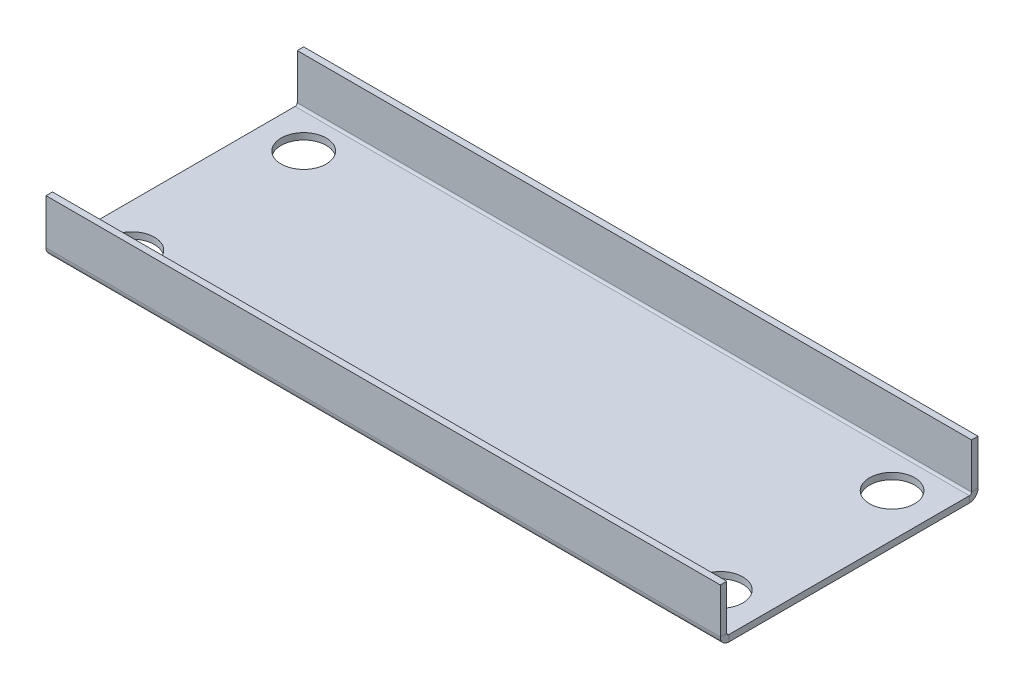
ISO-10303-21;
HEADER;
FILE_DESCRIPTION(('STEP AP214'),'2;1');
FILE_NAME('part.step','',(''),(''),'','','');
FILE_SCHEMA(('AUTOMOTIVE_DESIGN { 1 0 10303 214 1 1 1 1 }'));
ENDSEC;
DATA;
#1=APPLICATION_CONTEXT('core data for automotive mechanical design processes');
#2=APPLICATION_PROTOCOL_DEFINITION('international standard','automotive_design',2000,#1);
#3=PRODUCT_CONTEXT('',#1,'mechanical');
#4=PRODUCT('Part','Part','',(#3));
#5=PRODUCT_RELATED_PRODUCT_CATEGORY('part','',(#4));
#6=PRODUCT_DEFINITION_FORMATION('','',#4);
#7=PRODUCT_DEFINITION_CONTEXT('part definition',#1,'design');
#8=PRODUCT_DEFINITION('design','',#6,#7);
#9=PRODUCT_DEFINITION_SHAPE('','',#8);
#10=(LENGTH_UNIT() NAMED_UNIT(*) SI_UNIT(.MILLI.,.METRE.));
#11=(NAMED_UNIT(*) PLANE_ANGLE_UNIT() SI_UNIT($,.RADIAN.));
#12=(NAMED_UNIT(*) SI_UNIT($,.STERADIAN.) SOLID_ANGLE_UNIT());
#13=UNCERTAINTY_MEASURE_WITH_UNIT(LENGTH_MEASURE(1.E-05),#10,'distance_accuracy_value','');
#14=(GEOMETRIC_REPRESENTATION_CONTEXT(3) GLOBAL_UNCERTAINTY_ASSIGNED_CONTEXT((#13)) GLOBAL_UNIT_ASSIGNED_CONTEXT((#10,
#11,#12)) REPRESENTATION_CONTEXT('',''));
#15=CARTESIAN_POINT('',(0.,0.,0.));
#16=DIRECTION('',(0.,0.,1.));
#17=DIRECTION('',(1.,0.,0.));
#18=AXIS2_PLACEMENT_3D('',#15,#16,#17);
#19=CARTESIAN_POINT('',(0.,3.,0.));
#20=DIRECTION('',(0.,-1.,0.));
#21=DIRECTION('',(0.,0.,-1.));
#22=AXIS2_PLACEMENT_3D('',#19,#20,#21);
#23=PLANE('',#22);
#24=CARTESIAN_POINT('',(137.,3.,40.));
#25=DIRECTION('',(0.,-1.,0.));
#26=DIRECTION('',(0.,0.,-1.));
#27=AXIS2_PLACEMENT_3D('',#24,#25,#26);
#28=CIRCLE('',#27,10.5);
#29=CARTESIAN_POINT('',(137.,3.,29.5));
#30=VERTEX_POINT('',#29);
#31=EDGE_CURVE('E589',#30,#30,#28,.F.);
#32=ORIENTED_EDGE('',*,*,#31,.F.);
#33=EDGE_LOOP('',(#32));
#34=FACE_BOUND('',#33,.T.);
#35=CARTESIAN_POINT('',(137.,3.,-40.));
#36=DIRECTION('',(0.,-1.,0.));
#37=DIRECTION('',(0.,0.,-1.));
#38=AXIS2_PLACEMENT_3D('',#35,#36,#37);
#39=CIRCLE('',#38,10.5);
#40=CARTESIAN_POINT('',(137.,3.,-50.5));
#41=VERTEX_POINT('',#40);
#42=EDGE_CURVE('E596',#41,#41,#39,.F.);
#43=ORIENTED_EDGE('',*,*,#42,.F.);
#44=EDGE_LOOP('',(#43));
#45=FACE_BOUND('',#44,.T.);
#46=CARTESIAN_POINT('',(-137.,3.,-40.));
#47=DIRECTION('',(0.,-1.,0.));
#48=DIRECTION('',(0.,0.,-1.));
#49=AXIS2_PLACEMENT_3D('',#46,#47,#48);
#50=CIRCLE('',#49,10.5);
#51=CARTESIAN_POINT('',(-137.,3.,-50.5));
#52=VERTEX_POINT('',#51);
#53=EDGE_CURVE('E588',#52,#52,#50,.F.);
#54=ORIENTED_EDGE('',*,*,#53,.F.);
#55=EDGE_LOOP('',(#54));
#56=FACE_BOUND('',#55,.T.);
#57=CARTESIAN_POINT('',(-137.,3.,40.));
#58=DIRECTION('',(0.,-1.,0.));
#59=DIRECTION('',(0.,0.,-1.));
#60=AXIS2_PLACEMENT_3D('',#57,#58,#59);
#61=CIRCLE('',#60,10.5);
#62=CARTESIAN_POINT('',(-137.,3.,29.5));
#63=VERTEX_POINT('',#62);
#64=EDGE_CURVE('E575',#63,#63,#61,.F.);
#65=ORIENTED_EDGE('',*,*,#64,.F.);
#66=EDGE_LOOP('',(#65));
#67=FACE_BOUND('',#66,.T.);
#68=DIRECTION('',(-1.,0.,0.));
#69=VECTOR('',#68,1.);
#70=CARTESIAN_POINT('',(-157.,2.99999999999998,-56.));
#71=LINE('',#70,#69);
#72=CARTESIAN_POINT('',(-157.,2.99999999999998,-56.));
#73=VERTEX_POINT('',#72);
#74=CARTESIAN_POINT('',(157.,2.99999999999998,-56.));
#75=VERTEX_POINT('',#74);
#76=EDGE_CURVE('E182',#73,#75,#71,.F.);
#77=ORIENTED_EDGE('',*,*,#76,.F.);
#78=DIRECTION('',(0.,0.,1.));
#79=VECTOR('',#78,1.);
#80=CARTESIAN_POINT('',(-157.,3.,57.));
#81=LINE('',#80,#79);
#82=CARTESIAN_POINT('',(-157.,3.,56.));
#83=VERTEX_POINT('',#82);
#84=EDGE_CURVE('E11',#73,#83,#81,.T.);
#85=ORIENTED_EDGE('',*,*,#84,.T.);
#86=DIRECTION('',(1.,0.,0.));
#87=VECTOR('',#86,1.);
#88=CARTESIAN_POINT('',(157.,3.,56.));
#89=LINE('',#88,#87);
#90=CARTESIAN_POINT('',(157.,3.,56.));
#91=VERTEX_POINT('',#90);
#92=EDGE_CURVE('E230',#91,#83,#89,.F.);
#93=ORIENTED_EDGE('',*,*,#92,.F.);
#94=DIRECTION('',(0.,0.,-1.));
#95=VECTOR('',#94,1.);
#96=CARTESIAN_POINT('',(157.,3.,57.));
#97=LINE('',#96,#95);
#98=EDGE_CURVE('E47',#91,#75,#97,.T.);
#99=ORIENTED_EDGE('',*,*,#98,.T.);
#100=EDGE_LOOP('',(#77,#85,#93,#99));
#101=FACE_BOUND('',#100,.T.);
#102=ADVANCED_FACE('F38',(#34,#45,#56,#67,#101),#23,.F.);
#103=CARTESIAN_POINT('',(0.,0.,0.));
#104=DIRECTION('',(0.,-1.,0.));
#105=DIRECTION('',(0.,0.,-1.));
#106=AXIS2_PLACEMENT_3D('',#103,#104,#105);
#107=PLANE('',#106);
#108=CARTESIAN_POINT('',(137.,0.,40.));
#109=DIRECTION('',(0.,-1.,0.));
#110=DIRECTION('',(0.,0.,1.));
#111=AXIS2_PLACEMENT_3D('',#108,#109,#110);
#112=CIRCLE('',#111,10.5);
#113=CARTESIAN_POINT('',(137.,0.,50.5));
#114=VERTEX_POINT('',#113);
#115=EDGE_CURVE('E593',#114,#114,#112,.T.);
#116=ORIENTED_EDGE('',*,*,#115,.F.);
#117=EDGE_LOOP('',(#116));
#118=FACE_BOUND('',#117,.T.);
#119=CARTESIAN_POINT('',(137.,0.,-40.));
#120=DIRECTION('',(0.,-1.,0.));
#121=DIRECTION('',(0.,0.,-1.));
#122=AXIS2_PLACEMENT_3D('',#119,#120,#121);
#123=CIRCLE('',#122,10.5);
#124=CARTESIAN_POINT('',(137.,0.,-50.5));
#125=VERTEX_POINT('',#124);
#126=EDGE_CURVE('E592',#125,#125,#123,.T.);
#127=ORIENTED_EDGE('',*,*,#126,.F.);
#128=EDGE_LOOP('',(#127));
#129=FACE_BOUND('',#128,.T.);
#130=CARTESIAN_POINT('',(-137.,0.,-40.));
#131=DIRECTION('',(0.,-1.,0.));
#132=DIRECTION('',(0.,0.,1.));
#133=AXIS2_PLACEMENT_3D('',#130,#131,#132);
#134=CIRCLE('',#133,10.5);
#135=CARTESIAN_POINT('',(-137.,0.,-29.5));
#136=VERTEX_POINT('',#135);
#137=EDGE_CURVE('E599',#136,#136,#134,.T.);
#138=ORIENTED_EDGE('',*,*,#137,.F.);
#139=EDGE_LOOP('',(#138));
#140=FACE_BOUND('',#139,.T.);
#141=CARTESIAN_POINT('',(-137.,0.,40.));
#142=DIRECTION('',(0.,-1.,0.));
#143=DIRECTION('',(0.,0.,-1.));
#144=AXIS2_PLACEMENT_3D('',#141,#142,#143);
#145=CIRCLE('',#144,10.5);
#146=CARTESIAN_POINT('',(-137.,0.,29.5));
#147=VERTEX_POINT('',#146);
#148=EDGE_CURVE('E585',#147,#147,#145,.T.);
#149=ORIENTED_EDGE('',*,*,#148,.F.);
#150=EDGE_LOOP('',(#149));
#151=FACE_BOUND('',#150,.T.);
#152=DIRECTION('',(0.,0.,-1.));
#153=VECTOR('',#152,1.);
#154=CARTESIAN_POINT('',(-157.,0.,0.));
#155=LINE('',#154,#153);
#156=CARTESIAN_POINT('',(-157.,0.,-56.));
#157=VERTEX_POINT('',#156);
#158=CARTESIAN_POINT('',(-157.,0.,56.));
#159=VERTEX_POINT('',#158);
#160=EDGE_CURVE('E42',#157,#159,#155,.F.);
#161=ORIENTED_EDGE('',*,*,#160,.F.);
#162=DIRECTION('',(-1.,0.,0.));
#163=VECTOR('',#162,1.);
#164=CARTESIAN_POINT('',(-157.,0.,-56.));
#165=LINE('',#164,#163);
#166=CARTESIAN_POINT('',(157.,0.,-56.));
#167=VERTEX_POINT('',#166);
#168=EDGE_CURVE('E133',#157,#167,#165,.F.);
#169=ORIENTED_EDGE('',*,*,#168,.T.);
#170=DIRECTION('',(0.,0.,-1.));
#171=VECTOR('',#170,1.);
#172=CARTESIAN_POINT('',(157.,0.,0.));
#173=LINE('',#172,#171);
#174=CARTESIAN_POINT('',(157.,0.,56.));
#175=VERTEX_POINT('',#174);
#176=EDGE_CURVE('E236',#175,#167,#173,.T.);
#177=ORIENTED_EDGE('',*,*,#176,.F.);
#178=DIRECTION('',(1.,0.,0.));
#179=VECTOR('',#178,1.);
#180=CARTESIAN_POINT('',(157.,0.,56.));
#181=LINE('',#180,#179);
#182=EDGE_CURVE('E219',#175,#159,#181,.F.);
#183=ORIENTED_EDGE('',*,*,#182,.T.);
#184=EDGE_LOOP('',(#161,#169,#177,#183));
#185=FACE_BOUND('',#184,.T.);
#186=ADVANCED_FACE('F250',(#118,#129,#140,#151,#185),#107,.T.);
#187=CARTESIAN_POINT('',(-157.,3.,57.));
#188=DIRECTION('',(1.,0.,0.));
#189=DIRECTION('',(0.,0.,1.));
#190=AXIS2_PLACEMENT_3D('',#187,#188,#189);
#191=PLANE('',#190);
#192=ORIENTED_EDGE('',*,*,#84,.F.);
#193=DIRECTION('',(0.,-1.,0.));
#194=VECTOR('',#193,1.);
#195=CARTESIAN_POINT('',(-157.,2.99999999999998,-56.));
#196=LINE('',#195,#194);
#197=EDGE_CURVE('E178',#73,#157,#196,.T.);
#198=ORIENTED_EDGE('',*,*,#197,.T.);
#199=ORIENTED_EDGE('',*,*,#160,.T.);
#200=DIRECTION('',(0.,-1.,0.));
#201=VECTOR('',#200,1.);
#202=CARTESIAN_POINT('',(-157.,3.,56.));
#203=LINE('',#202,#201);
#204=EDGE_CURVE('E234',#83,#159,#203,.T.);
#205=ORIENTED_EDGE('',*,*,#204,.F.);
#206=EDGE_LOOP('',(#192,#198,#199,#205));
#207=FACE_BOUND('',#206,.T.);
#208=ADVANCED_FACE('F40',(#207),#191,.F.);
#209=CARTESIAN_POINT('',(157.,3.,57.));
#210=DIRECTION('',(-1.,0.,0.));
#211=DIRECTION('',(0.,0.,-1.));
#212=AXIS2_PLACEMENT_3D('',#209,#210,#211);
#213=PLANE('',#212);
#214=DIRECTION('',(0.,-1.,0.));
#215=VECTOR('',#214,1.);
#216=CARTESIAN_POINT('',(157.,2.99999999999998,-56.));
#217=LINE('',#216,#215);
#218=EDGE_CURVE('E185',#75,#167,#217,.T.);
#219=ORIENTED_EDGE('',*,*,#218,.F.);
#220=ORIENTED_EDGE('',*,*,#98,.F.);
#221=DIRECTION('',(0.,-1.,0.));
#222=VECTOR('',#221,1.);
#223=CARTESIAN_POINT('',(157.,3.,56.));
#224=LINE('',#223,#222);
#225=EDGE_CURVE('E224',#91,#175,#224,.T.);
#226=ORIENTED_EDGE('',*,*,#225,.T.);
#227=ORIENTED_EDGE('',*,*,#176,.T.);
#228=EDGE_LOOP('',(#219,#220,#226,#227));
#229=FACE_BOUND('',#228,.T.);
#230=ADVANCED_FACE('F258',(#229),#213,.F.);
#231=CARTESIAN_POINT('',(-157.,4.,56.));
#232=DIRECTION('',(-1.,0.,0.));
#233=DIRECTION('',(0.,0.,1.));
#234=AXIS2_PLACEMENT_3D('',#231,#232,#233);
#235=PLANE('',#234);
#236=DIRECTION('',(0.,0.,1.));
#237=VECTOR('',#236,1.);
#238=CARTESIAN_POINT('',(-157.,4.,57.));
#239=LINE('',#238,#237);
#240=CARTESIAN_POINT('',(-157.,4.,57.));
#241=VERTEX_POINT('',#240);
#242=CARTESIAN_POINT('',(-157.,4.,60.));
#243=VERTEX_POINT('',#242);
#244=EDGE_CURVE('E187',#241,#243,#239,.T.);
#245=ORIENTED_EDGE('',*,*,#244,.F.);
#246=CARTESIAN_POINT('',(-157.,4.,56.));
#247=DIRECTION('',(1.,0.,0.));
#248=DIRECTION('',(0.,0.,-1.));
#249=AXIS2_PLACEMENT_3D('',#246,#247,#248);
#250=CIRCLE('',#249,1.);
#251=EDGE_CURVE('E227',#83,#241,#250,.F.);
#252=ORIENTED_EDGE('',*,*,#251,.F.);
#253=ORIENTED_EDGE('',*,*,#204,.T.);
#254=CARTESIAN_POINT('',(-157.,4.,56.));
#255=DIRECTION('',(1.,0.,0.));
#256=DIRECTION('',(0.,0.,-1.));
#257=AXIS2_PLACEMENT_3D('',#254,#255,#256);
#258=CIRCLE('',#257,4.);
#259=EDGE_CURVE('E55',#159,#243,#258,.F.);
#260=ORIENTED_EDGE('',*,*,#259,.T.);
#261=EDGE_LOOP('',(#245,#252,#253,#260));
#262=FACE_BOUND('',#261,.T.);
#263=ADVANCED_FACE('F267',(#262),#235,.T.);
#264=CARTESIAN_POINT('',(157.,4.,56.));
#265=DIRECTION('',(-1.,0.,0.));
#266=DIRECTION('',(0.,0.,1.));
#267=AXIS2_PLACEMENT_3D('',#264,#265,#266);
#268=PLANE('',#267);
#269=CARTESIAN_POINT('',(157.,4.,56.));
#270=DIRECTION('',(1.,0.,0.));
#271=DIRECTION('',(0.,0.,-1.));
#272=AXIS2_PLACEMENT_3D('',#269,#270,#271);
#273=CIRCLE('',#272,1.);
#274=CARTESIAN_POINT('',(157.,4.,57.));
#275=VERTEX_POINT('',#274);
#276=EDGE_CURVE('E218',#275,#91,#273,.T.);
#277=ORIENTED_EDGE('',*,*,#276,.F.);
#278=DIRECTION('',(0.,0.,1.));
#279=VECTOR('',#278,1.);
#280=CARTESIAN_POINT('',(157.,4.00000000000001,57.));
#281=LINE('',#280,#279);
#282=CARTESIAN_POINT('',(157.,4.00000000000001,60.));
#283=VERTEX_POINT('',#282);
#284=EDGE_CURVE('E191',#275,#283,#281,.T.);
#285=ORIENTED_EDGE('',*,*,#284,.T.);
#286=CARTESIAN_POINT('',(157.,4.,56.));
#287=DIRECTION('',(1.,0.,0.));
#288=DIRECTION('',(0.,0.,-1.));
#289=AXIS2_PLACEMENT_3D('',#286,#287,#288);
#290=CIRCLE('',#289,4.);
#291=EDGE_CURVE('E222',#283,#175,#290,.T.);
#292=ORIENTED_EDGE('',*,*,#291,.T.);
#293=ORIENTED_EDGE('',*,*,#225,.F.);
#294=EDGE_LOOP('',(#277,#285,#292,#293));
#295=FACE_BOUND('',#294,.T.);
#296=ADVANCED_FACE('F254',(#295),#268,.F.);
#297=CARTESIAN_POINT('',(157.,4.,56.));
#298=DIRECTION('',(1.,0.,0.));
#299=DIRECTION('',(0.,0.,1.));
#300=AXIS2_PLACEMENT_3D('',#297,#298,#299);
#301=CYLINDRICAL_SURFACE('',#300,4.);
#302=ORIENTED_EDGE('',*,*,#182,.F.);
#303=ORIENTED_EDGE('',*,*,#291,.F.);
#304=DIRECTION('',(-1.,0.,0.));
#305=VECTOR('',#304,1.);
#306=CARTESIAN_POINT('',(0.,4.,60.));
#307=LINE('',#306,#305);
#308=EDGE_CURVE('E194',#283,#243,#307,.T.);
#309=ORIENTED_EDGE('',*,*,#308,.T.);
#310=ORIENTED_EDGE('',*,*,#259,.F.);
#311=EDGE_LOOP('',(#302,#303,#309,#310));
#312=FACE_BOUND('',#311,.T.);
#313=ADVANCED_FACE('F251',(#312),#301,.T.);
#314=CARTESIAN_POINT('',(157.,4.,56.));
#315=DIRECTION('',(1.,0.,0.));
#316=DIRECTION('',(0.,0.,1.));
#317=AXIS2_PLACEMENT_3D('',#314,#315,#316);
#318=CYLINDRICAL_SURFACE('',#317,1.);
#319=ORIENTED_EDGE('',*,*,#92,.T.);
#320=ORIENTED_EDGE('',*,*,#251,.T.);
#321=DIRECTION('',(1.,0.,0.));
#322=VECTOR('',#321,1.);
#323=CARTESIAN_POINT('',(-157.,4.,57.));
#324=LINE('',#323,#322);
#325=EDGE_CURVE('E189',#241,#275,#324,.T.);
#326=ORIENTED_EDGE('',*,*,#325,.T.);
#327=ORIENTED_EDGE('',*,*,#276,.T.);
#328=EDGE_LOOP('',(#319,#320,#326,#327));
#329=FACE_BOUND('',#328,.T.);
#330=ADVANCED_FACE('F264',(#329),#318,.F.);
#331=CARTESIAN_POINT('',(-157.,3.,60.));
#332=DIRECTION('',(1.,0.,0.));
#333=DIRECTION('',(0.,1.,0.));
#334=AXIS2_PLACEMENT_3D('',#331,#332,#333);
#335=PLANE('',#334);
#336=ORIENTED_EDGE('',*,*,#244,.T.);
#337=DIRECTION('',(0.,-1.,0.));
#338=VECTOR('',#337,1.);
#339=CARTESIAN_POINT('',(-157.,3.,60.));
#340=LINE('',#339,#338);
#341=CARTESIAN_POINT('',(-157.,25.,60.));
#342=VERTEX_POINT('',#341);
#343=EDGE_CURVE('E199',#342,#243,#340,.T.);
#344=ORIENTED_EDGE('',*,*,#343,.F.);
#345=DIRECTION('',(0.,0.,-1.));
#346=VECTOR('',#345,1.);
#347=CARTESIAN_POINT('',(-157.,25.,60.));
#348=LINE('',#347,#346);
#349=CARTESIAN_POINT('',(-157.,25.,57.));
#350=VERTEX_POINT('',#349);
#351=EDGE_CURVE('E207',#342,#350,#348,.T.);
#352=ORIENTED_EDGE('',*,*,#351,.T.);
#353=DIRECTION('',(0.,-1.,0.));
#354=VECTOR('',#353,1.);
#355=CARTESIAN_POINT('',(-157.,3.,57.));
#356=LINE('',#355,#354);
#357=EDGE_CURVE('E198',#350,#241,#356,.T.);
#358=ORIENTED_EDGE('',*,*,#357,.T.);
#359=EDGE_LOOP('',(#336,#344,#352,#358));
#360=FACE_BOUND('',#359,.T.);
#361=ADVANCED_FACE('F270',(#360),#335,.F.);
#362=CARTESIAN_POINT('',(157.,25.,60.));
#363=DIRECTION('',(-1.,0.,0.));
#364=DIRECTION('',(0.,-1.,0.));
#365=AXIS2_PLACEMENT_3D('',#362,#363,#364);
#366=PLANE('',#365);
#367=ORIENTED_EDGE('',*,*,#284,.F.);
#368=DIRECTION('',(0.,1.,0.));
#369=VECTOR('',#368,1.);
#370=CARTESIAN_POINT('',(157.,25.,57.));
#371=LINE('',#370,#369);
#372=CARTESIAN_POINT('',(157.,25.,57.));
#373=VERTEX_POINT('',#372);
#374=EDGE_CURVE('E210',#275,#373,#371,.T.);
#375=ORIENTED_EDGE('',*,*,#374,.T.);
#376=DIRECTION('',(0.,0.,-1.));
#377=VECTOR('',#376,1.);
#378=CARTESIAN_POINT('',(157.,25.,60.));
#379=LINE('',#378,#377);
#380=CARTESIAN_POINT('',(157.,25.,60.));
#381=VERTEX_POINT('',#380);
#382=EDGE_CURVE('E215',#381,#373,#379,.T.);
#383=ORIENTED_EDGE('',*,*,#382,.F.);
#384=DIRECTION('',(0.,1.,0.));
#385=VECTOR('',#384,1.);
#386=CARTESIAN_POINT('',(157.,25.,60.));
#387=LINE('',#386,#385);
#388=EDGE_CURVE('E202',#283,#381,#387,.T.);
#389=ORIENTED_EDGE('',*,*,#388,.F.);
#390=EDGE_LOOP('',(#367,#375,#383,#389));
#391=FACE_BOUND('',#390,.T.);
#392=ADVANCED_FACE('F285',(#391),#366,.F.);
#393=CARTESIAN_POINT('',(0.,0.,60.));
#394=DIRECTION('',(0.,0.,-1.));
#395=DIRECTION('',(-1.,0.,0.));
#396=AXIS2_PLACEMENT_3D('',#393,#394,#395);
#397=PLANE('',#396);
#398=ORIENTED_EDGE('',*,*,#308,.F.);
#399=ORIENTED_EDGE('',*,*,#388,.T.);
#400=DIRECTION('',(-1.,0.,0.));
#401=VECTOR('',#400,1.);
#402=CARTESIAN_POINT('',(-157.,25.,60.));
#403=LINE('',#402,#401);
#404=EDGE_CURVE('E205',#381,#342,#403,.T.);
#405=ORIENTED_EDGE('',*,*,#404,.T.);
#406=ORIENTED_EDGE('',*,*,#343,.T.);
#407=EDGE_LOOP('',(#398,#399,#405,#406));
#408=FACE_BOUND('',#407,.T.);
#409=ADVANCED_FACE('F273',(#408),#397,.F.);
#410=CARTESIAN_POINT('',(0.,0.,57.));
#411=DIRECTION('',(0.,0.,-1.));
#412=DIRECTION('',(-1.,0.,0.));
#413=AXIS2_PLACEMENT_3D('',#410,#411,#412);
#414=PLANE('',#413);
#415=ORIENTED_EDGE('',*,*,#374,.F.);
#416=ORIENTED_EDGE('',*,*,#325,.F.);
#417=ORIENTED_EDGE('',*,*,#357,.F.);
#418=DIRECTION('',(-1.,0.,0.));
#419=VECTOR('',#418,1.);
#420=CARTESIAN_POINT('',(-157.,25.,57.));
#421=LINE('',#420,#419);
#422=EDGE_CURVE('E203',#373,#350,#421,.T.);
#423=ORIENTED_EDGE('',*,*,#422,.F.);
#424=EDGE_LOOP('',(#415,#416,#417,#423));
#425=FACE_BOUND('',#424,.T.);
#426=ADVANCED_FACE('F283',(#425),#414,.T.);
#427=CARTESIAN_POINT('',(-157.,25.,60.));
#428=DIRECTION('',(0.,-1.,0.));
#429=DIRECTION('',(0.,0.,-1.));
#430=AXIS2_PLACEMENT_3D('',#427,#428,#429);
#431=PLANE('',#430);
#432=ORIENTED_EDGE('',*,*,#422,.T.);
#433=ORIENTED_EDGE('',*,*,#351,.F.);
#434=ORIENTED_EDGE('',*,*,#404,.F.);
#435=ORIENTED_EDGE('',*,*,#382,.T.);
#436=EDGE_LOOP('',(#432,#433,#434,#435));
#437=FACE_BOUND('',#436,.T.);
#438=ADVANCED_FACE('F279',(#437),#431,.F.);
#439=CARTESIAN_POINT('',(157.,3.99999999999998,-56.));
#440=DIRECTION('',(1.,0.,0.));
#441=DIRECTION('',(0.,0.,-1.));
#442=AXIS2_PLACEMENT_3D('',#439,#440,#441);
#443=PLANE('',#442);
#444=DIRECTION('',(0.,0.,-1.));
#445=VECTOR('',#444,1.);
#446=CARTESIAN_POINT('',(157.,4.,-57.));
#447=LINE('',#446,#445);
#448=CARTESIAN_POINT('',(157.,3.99999999999998,-57.));
#449=VERTEX_POINT('',#448);
#450=CARTESIAN_POINT('',(157.,3.99999999999997,-60.));
#451=VERTEX_POINT('',#450);
#452=EDGE_CURVE('E574',#449,#451,#447,.T.);
#453=ORIENTED_EDGE('',*,*,#452,.F.);
#454=CARTESIAN_POINT('',(157.,3.99999999999998,-56.));
#455=DIRECTION('',(-1.,0.,0.));
#456=DIRECTION('',(0.,0.,1.));
#457=AXIS2_PLACEMENT_3D('',#454,#455,#456);
#458=CIRCLE('',#457,1.);
#459=EDGE_CURVE('E136',#75,#449,#458,.F.);
#460=ORIENTED_EDGE('',*,*,#459,.F.);
#461=ORIENTED_EDGE('',*,*,#218,.T.);
#462=CARTESIAN_POINT('',(157.,3.99999999999998,-56.));
#463=DIRECTION('',(-1.,0.,0.));
#464=DIRECTION('',(0.,0.,1.));
#465=AXIS2_PLACEMENT_3D('',#462,#463,#464);
#466=CIRCLE('',#465,4.);
#467=EDGE_CURVE('E63',#167,#451,#466,.F.);
#468=ORIENTED_EDGE('',*,*,#467,.T.);
#469=EDGE_LOOP('',(#453,#460,#461,#468));
#470=FACE_BOUND('',#469,.T.);
#471=ADVANCED_FACE('F443',(#470),#443,.T.);
#472=CARTESIAN_POINT('',(-157.,3.99999999999998,-56.));
#473=DIRECTION('',(1.,0.,0.));
#474=DIRECTION('',(0.,0.,-1.));
#475=AXIS2_PLACEMENT_3D('',#472,#473,#474);
#476=PLANE('',#475);
#477=CARTESIAN_POINT('',(-157.,3.99999999999998,-56.));
#478=DIRECTION('',(-1.,0.,0.));
#479=DIRECTION('',(0.,0.,1.));
#480=AXIS2_PLACEMENT_3D('',#477,#478,#479);
#481=CIRCLE('',#480,1.);
#482=CARTESIAN_POINT('',(-157.,3.99999999999998,-57.));
#483=VERTEX_POINT('',#482);
#484=EDGE_CURVE('E143',#483,#73,#481,.T.);
#485=ORIENTED_EDGE('',*,*,#484,.F.);
#486=DIRECTION('',(0.,0.,-1.));
#487=VECTOR('',#486,1.);
#488=CARTESIAN_POINT('',(-157.,3.99999999999998,-57.));
#489=LINE('',#488,#487);
#490=CARTESIAN_POINT('',(-157.,4.,-60.));
#491=VERTEX_POINT('',#490);
#492=EDGE_CURVE('E140',#483,#491,#489,.T.);
#493=ORIENTED_EDGE('',*,*,#492,.T.);
#494=CARTESIAN_POINT('',(-157.,3.99999999999998,-56.));
#495=DIRECTION('',(-1.,0.,0.));
#496=DIRECTION('',(0.,0.,1.));
#497=AXIS2_PLACEMENT_3D('',#494,#495,#496);
#498=CIRCLE('',#497,4.);
#499=EDGE_CURVE('E127',#491,#157,#498,.T.);
#500=ORIENTED_EDGE('',*,*,#499,.T.);
#501=ORIENTED_EDGE('',*,*,#197,.F.);
#502=EDGE_LOOP('',(#485,#493,#500,#501));
#503=FACE_BOUND('',#502,.T.);
#504=ADVANCED_FACE('F141',(#503),#476,.F.);
#505=CARTESIAN_POINT('',(-157.,3.99999999999998,-56.));
#506=DIRECTION('',(-1.,0.,0.));
#507=DIRECTION('',(0.,0.,-1.));
#508=AXIS2_PLACEMENT_3D('',#505,#506,#507);
#509=CYLINDRICAL_SURFACE('',#508,4.);
#510=ORIENTED_EDGE('',*,*,#168,.F.);
#511=ORIENTED_EDGE('',*,*,#499,.F.);
#512=DIRECTION('',(1.,0.,0.));
#513=VECTOR('',#512,1.);
#514=CARTESIAN_POINT('',(0.,4.00000000000001,-60.));
#515=LINE('',#514,#513);
#516=EDGE_CURVE('E131',#491,#451,#515,.T.);
#517=ORIENTED_EDGE('',*,*,#516,.T.);
#518=ORIENTED_EDGE('',*,*,#467,.F.);
#519=EDGE_LOOP('',(#510,#511,#517,#518));
#520=FACE_BOUND('',#519,.T.);
#521=ADVANCED_FACE('F129',(#520),#509,.T.);
#522=CARTESIAN_POINT('',(-157.,3.99999999999998,-56.));
#523=DIRECTION('',(-1.,0.,0.));
#524=DIRECTION('',(0.,0.,-1.));
#525=AXIS2_PLACEMENT_3D('',#522,#523,#524);
#526=CYLINDRICAL_SURFACE('',#525,1.);
#527=ORIENTED_EDGE('',*,*,#76,.T.);
#528=ORIENTED_EDGE('',*,*,#459,.T.);
#529=DIRECTION('',(-1.,0.,0.));
#530=VECTOR('',#529,1.);
#531=CARTESIAN_POINT('',(157.,4.,-57.));
#532=LINE('',#531,#530);
#533=EDGE_CURVE('E147',#449,#483,#532,.T.);
#534=ORIENTED_EDGE('',*,*,#533,.T.);
#535=ORIENTED_EDGE('',*,*,#484,.T.);
#536=EDGE_LOOP('',(#527,#528,#534,#535));
#537=FACE_BOUND('',#536,.T.);
#538=ADVANCED_FACE('F416',(#537),#526,.F.);
#539=CARTESIAN_POINT('',(157.,2.99999999999999,-60.));
#540=DIRECTION('',(-1.,0.,0.));
#541=DIRECTION('',(0.,-1.,0.));
#542=AXIS2_PLACEMENT_3D('',#539,#540,#541);
#543=PLANE('',#542);
#544=ORIENTED_EDGE('',*,*,#452,.T.);
#545=DIRECTION('',(0.,-1.,0.));
#546=VECTOR('',#545,1.);
#547=CARTESIAN_POINT('',(157.,2.99999999999999,-60.));
#548=LINE('',#547,#546);
#549=CARTESIAN_POINT('',(157.,25.,-60.0000000000001));
#550=VERTEX_POINT('',#549);
#551=EDGE_CURVE('E155',#550,#451,#548,.T.);
#552=ORIENTED_EDGE('',*,*,#551,.F.);
#553=DIRECTION('',(0.,0.,1.));
#554=VECTOR('',#553,1.);
#555=CARTESIAN_POINT('',(157.,25.,-60.0000000000001));
#556=LINE('',#555,#554);
#557=CARTESIAN_POINT('',(157.,25.,-57.0000000000001));
#558=VERTEX_POINT('',#557);
#559=EDGE_CURVE('E164',#550,#558,#556,.T.);
#560=ORIENTED_EDGE('',*,*,#559,.T.);
#561=DIRECTION('',(0.,-1.,0.));
#562=VECTOR('',#561,1.);
#563=CARTESIAN_POINT('',(157.,3.,-57.));
#564=LINE('',#563,#562);
#565=EDGE_CURVE('E156',#558,#449,#564,.T.);
#566=ORIENTED_EDGE('',*,*,#565,.T.);
#567=EDGE_LOOP('',(#544,#552,#560,#566));
#568=FACE_BOUND('',#567,.T.);
#569=ADVANCED_FACE('F407',(#568),#543,.F.);
#570=CARTESIAN_POINT('',(-157.,25.,-60.0000000000001));
#571=DIRECTION('',(1.,0.,0.));
#572=DIRECTION('',(0.,1.,0.));
#573=AXIS2_PLACEMENT_3D('',#570,#571,#572);
#574=PLANE('',#573);
#575=ORIENTED_EDGE('',*,*,#492,.F.);
#576=DIRECTION('',(0.,1.,0.));
#577=VECTOR('',#576,1.);
#578=CARTESIAN_POINT('',(-157.,25.,-57.0000000000001));
#579=LINE('',#578,#577);
#580=CARTESIAN_POINT('',(-157.,25.,-57.0000000000001));
#581=VERTEX_POINT('',#580);
#582=EDGE_CURVE('E171',#483,#581,#579,.T.);
#583=ORIENTED_EDGE('',*,*,#582,.T.);
#584=DIRECTION('',(0.,0.,1.));
#585=VECTOR('',#584,1.);
#586=CARTESIAN_POINT('',(-157.,25.,-60.0000000000001));
#587=LINE('',#586,#585);
#588=CARTESIAN_POINT('',(-157.,25.,-60.0000000000001));
#589=VERTEX_POINT('',#588);
#590=EDGE_CURVE('E160',#589,#581,#587,.T.);
#591=ORIENTED_EDGE('',*,*,#590,.F.);
#592=DIRECTION('',(0.,1.,0.));
#593=VECTOR('',#592,1.);
#594=CARTESIAN_POINT('',(-157.,25.,-60.0000000000001));
#595=LINE('',#594,#593);
#596=EDGE_CURVE('E152',#491,#589,#595,.T.);
#597=ORIENTED_EDGE('',*,*,#596,.F.);
#598=EDGE_LOOP('',(#575,#583,#591,#597));
#599=FACE_BOUND('',#598,.T.);
#600=ADVANCED_FACE('F158',(#599),#574,.F.);
#601=CARTESIAN_POINT('',(0.,-2.08232920277885E-13,-60.));
#602=DIRECTION('',(0.,0.,1.));
#603=DIRECTION('',(0.,-1.,0.));
#604=AXIS2_PLACEMENT_3D('',#601,#602,#603);
#605=PLANE('',#604);
#606=ORIENTED_EDGE('',*,*,#516,.F.);
#607=ORIENTED_EDGE('',*,*,#596,.T.);
#608=DIRECTION('',(1.,0.,0.));
#609=VECTOR('',#608,1.);
#610=CARTESIAN_POINT('',(157.,25.,-60.0000000000001));
#611=LINE('',#610,#609);
#612=EDGE_CURVE('E162',#589,#550,#611,.T.);
#613=ORIENTED_EDGE('',*,*,#612,.T.);
#614=ORIENTED_EDGE('',*,*,#551,.T.);
#615=EDGE_LOOP('',(#606,#607,#613,#614));
#616=FACE_BOUND('',#615,.T.);
#617=ADVANCED_FACE('F151',(#616),#605,.F.);
#618=CARTESIAN_POINT('',(0.,-1.97758476261356E-13,-57.));
#619=DIRECTION('',(0.,0.,1.));
#620=DIRECTION('',(0.,-1.,0.));
#621=AXIS2_PLACEMENT_3D('',#618,#619,#620);
#622=PLANE('',#621);
#623=ORIENTED_EDGE('',*,*,#582,.F.);
#624=ORIENTED_EDGE('',*,*,#533,.F.);
#625=ORIENTED_EDGE('',*,*,#565,.F.);
#626=DIRECTION('',(1.,0.,0.));
#627=VECTOR('',#626,1.);
#628=CARTESIAN_POINT('',(157.,25.,-57.0000000000001));
#629=LINE('',#628,#627);
#630=EDGE_CURVE('E166',#581,#558,#629,.T.);
#631=ORIENTED_EDGE('',*,*,#630,.F.);
#632=EDGE_LOOP('',(#623,#624,#625,#631));
#633=FACE_BOUND('',#632,.T.);
#634=ADVANCED_FACE('F381',(#633),#622,.T.);
#635=CARTESIAN_POINT('',(157.,25.,-60.0000000000001));
#636=DIRECTION('',(0.,-1.,0.));
#637=DIRECTION('',(0.,0.,-1.));
#638=AXIS2_PLACEMENT_3D('',#635,#636,#637);
#639=PLANE('',#638);
#640=ORIENTED_EDGE('',*,*,#630,.T.);
#641=ORIENTED_EDGE('',*,*,#559,.F.);
#642=ORIENTED_EDGE('',*,*,#612,.F.);
#643=ORIENTED_EDGE('',*,*,#590,.T.);
#644=EDGE_LOOP('',(#640,#641,#642,#643));
#645=FACE_BOUND('',#644,.T.);
#646=ADVANCED_FACE('F334',(#645),#639,.F.);
#647=CARTESIAN_POINT('',(-137.,25.001,40.));
#648=DIRECTION('',(0.,-1.,0.));
#649=DIRECTION('',(0.,0.,-1.));
#650=AXIS2_PLACEMENT_3D('',#647,#648,#649);
#651=CYLINDRICAL_SURFACE('',#650,10.5);
#652=ORIENTED_EDGE('',*,*,#148,.T.);
#653=EDGE_LOOP('',(#652));
#654=FACE_BOUND('',#653,.T.);
#655=ORIENTED_EDGE('',*,*,#64,.T.);
#656=EDGE_LOOP('',(#655));
#657=FACE_BOUND('',#656,.T.);
#658=ADVANCED_FACE('F328',(#654,#657),#651,.F.);
#659=CARTESIAN_POINT('',(-137.,25.001,-40.));
#660=DIRECTION('',(0.,-1.,0.));
#661=DIRECTION('',(0.,0.,-1.));
#662=AXIS2_PLACEMENT_3D('',#659,#660,#661);
#663=CYLINDRICAL_SURFACE('',#662,10.5);
#664=ORIENTED_EDGE('',*,*,#137,.T.);
#665=EDGE_LOOP('',(#664));
#666=FACE_BOUND('',#665,.T.);
#667=ORIENTED_EDGE('',*,*,#53,.T.);
#668=EDGE_LOOP('',(#667));
#669=FACE_BOUND('',#668,.T.);
#670=ADVANCED_FACE('F333',(#666,#669),#663,.F.);
#671=CARTESIAN_POINT('',(137.,25.001,-40.));
#672=DIRECTION('',(0.,-1.,0.));
#673=DIRECTION('',(0.,0.,-1.));
#674=AXIS2_PLACEMENT_3D('',#671,#672,#673);
#675=CYLINDRICAL_SURFACE('',#674,10.5);
#676=ORIENTED_EDGE('',*,*,#126,.T.);
#677=EDGE_LOOP('',(#676));
#678=FACE_BOUND('',#677,.T.);
#679=ORIENTED_EDGE('',*,*,#42,.T.);
#680=EDGE_LOOP('',(#679));
#681=FACE_BOUND('',#680,.T.);
#682=ADVANCED_FACE('F347',(#678,#681),#675,.F.);
#683=CARTESIAN_POINT('',(137.,25.001,40.));
#684=DIRECTION('',(0.,-1.,0.));
#685=DIRECTION('',(0.,0.,-1.));
#686=AXIS2_PLACEMENT_3D('',#683,#684,#685);
#687=CYLINDRICAL_SURFACE('',#686,10.5);
#688=ORIENTED_EDGE('',*,*,#115,.T.);
#689=EDGE_LOOP('',(#688));
#690=FACE_BOUND('',#689,.T.);
#691=ORIENTED_EDGE('',*,*,#31,.T.);
#692=EDGE_LOOP('',(#691));
#693=FACE_BOUND('',#692,.T.);
#694=ADVANCED_FACE('F358',(#690,#693),#687,.F.);
#695=CLOSED_SHELL('',(#102,#186,#208,#230,#263,#296,#313,#330,#361,#392,#409,#426,#438,#471,
#504,#521,#538,#569,#600,#617,#634,#646,#658,#670,#682,#694));
#696=MANIFOLD_SOLID_BREP('B2',#695);
#697=ADVANCED_BREP_SHAPE_REPRESENTATION('',(#18,#696),#14);
#698=SHAPE_DEFINITION_REPRESENTATION(#9,#697);
ENDSEC;
END-ISO-10303-21;
